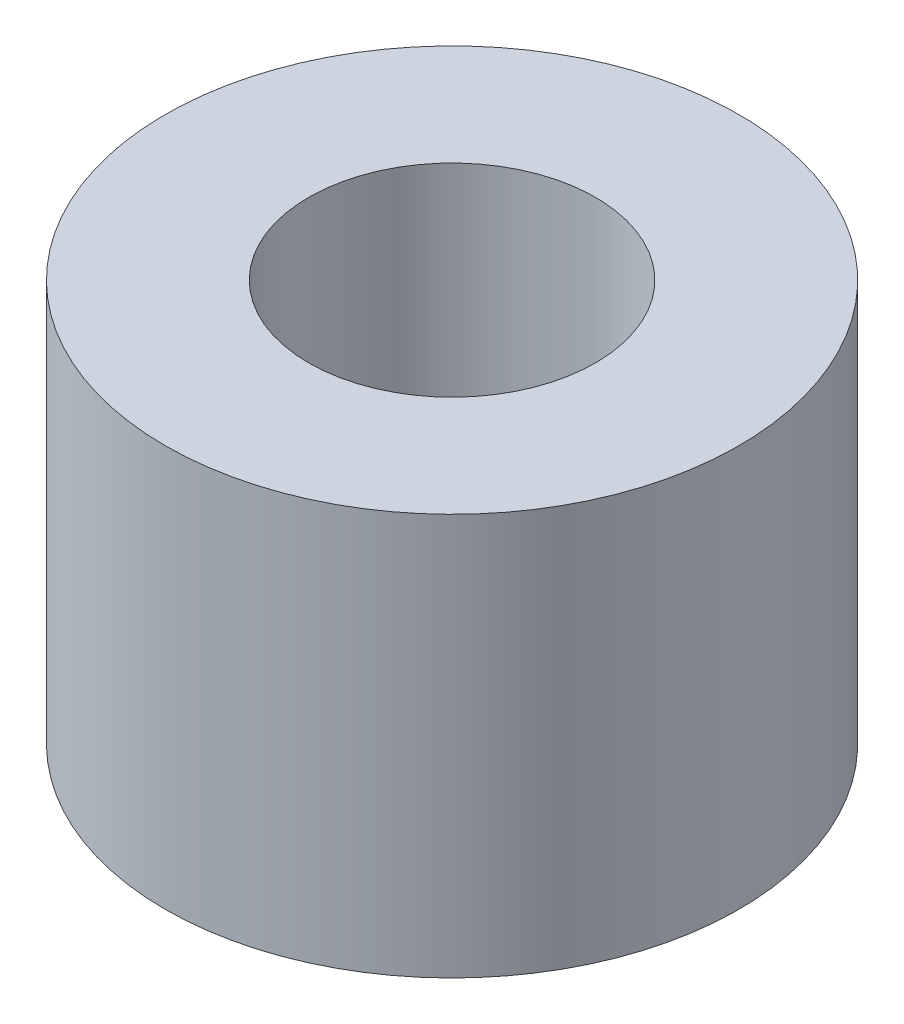
ISO-10303-21;
HEADER;
FILE_DESCRIPTION(('STEP AP214'),'2;1');
FILE_NAME('part.step','',(''),(''),'','','');
FILE_SCHEMA(('AUTOMOTIVE_DESIGN { 1 0 10303 214 1 1 1 1 }'));
ENDSEC;
DATA;
#1=APPLICATION_CONTEXT('core data for automotive mechanical design processes');
#2=APPLICATION_PROTOCOL_DEFINITION('international standard','automotive_design',2000,#1);
#3=PRODUCT_CONTEXT('',#1,'mechanical');
#4=PRODUCT('Part','Part','',(#3));
#5=PRODUCT_RELATED_PRODUCT_CATEGORY('part','',(#4));
#6=PRODUCT_DEFINITION_FORMATION('','',#4);
#7=PRODUCT_DEFINITION_CONTEXT('part definition',#1,'design');
#8=PRODUCT_DEFINITION('design','',#6,#7);
#9=PRODUCT_DEFINITION_SHAPE('','',#8);
#10=(LENGTH_UNIT() NAMED_UNIT(*) SI_UNIT(.MILLI.,.METRE.));
#11=(NAMED_UNIT(*) PLANE_ANGLE_UNIT() SI_UNIT($,.RADIAN.));
#12=(NAMED_UNIT(*) SI_UNIT($,.STERADIAN.) SOLID_ANGLE_UNIT());
#13=UNCERTAINTY_MEASURE_WITH_UNIT(LENGTH_MEASURE(1.E-05),#10,'distance_accuracy_value','');
#14=(GEOMETRIC_REPRESENTATION_CONTEXT(3) GLOBAL_UNCERTAINTY_ASSIGNED_CONTEXT((#13)) GLOBAL_UNIT_ASSIGNED_CONTEXT((#10,
#11,#12)) REPRESENTATION_CONTEXT('',''));
#15=CARTESIAN_POINT('',(0.,0.,0.));
#16=DIRECTION('',(0.,0.,1.));
#17=DIRECTION('',(1.,0.,0.));
#18=AXIS2_PLACEMENT_3D('',#15,#16,#17);
#19=CARTESIAN_POINT('',(0.,5.6,0.));
#20=DIRECTION('',(0.,1.,0.));
#21=DIRECTION('',(0.,0.,1.));
#22=AXIS2_PLACEMENT_3D('',#19,#20,#21);
#23=PLANE('',#22);
#24=CARTESIAN_POINT('',(0.,5.6,0.));
#25=DIRECTION('',(0.,1.,0.));
#26=DIRECTION('',(0.,0.,1.));
#27=AXIS2_PLACEMENT_3D('',#24,#25,#26);
#28=CIRCLE('',#27,4.);
#29=CARTESIAN_POINT('',(0.,5.6,3.99999999999998));
#30=VERTEX_POINT('',#29);
#31=EDGE_CURVE('E10',#30,#30,#28,.T.);
#32=ORIENTED_EDGE('',*,*,#31,.T.);
#33=EDGE_LOOP('',(#32));
#34=FACE_BOUND('',#33,.T.);
#35=CARTESIAN_POINT('',(0.,5.6,0.));
#36=DIRECTION('',(0.,1.,0.));
#37=DIRECTION('',(0.,0.,1.));
#38=AXIS2_PLACEMENT_3D('',#35,#36,#37);
#39=CIRCLE('',#38,2.);
#40=CARTESIAN_POINT('',(0.,5.6,1.99999999999998));
#41=VERTEX_POINT('',#40);
#42=EDGE_CURVE('E46',#41,#41,#39,.T.);
#43=ORIENTED_EDGE('',*,*,#42,.F.);
#44=EDGE_LOOP('',(#43));
#45=FACE_BOUND('',#44,.T.);
#46=ADVANCED_FACE('F35',(#34,#45),#23,.T.);
#47=CARTESIAN_POINT('',(0.,0.,0.));
#48=DIRECTION('',(0.,1.,0.));
#49=DIRECTION('',(0.,0.,1.));
#50=AXIS2_PLACEMENT_3D('',#47,#48,#49);
#51=PLANE('',#50);
#52=CARTESIAN_POINT('',(0.,0.,0.));
#53=DIRECTION('',(0.,1.,0.));
#54=DIRECTION('',(0.,0.,1.));
#55=AXIS2_PLACEMENT_3D('',#52,#53,#54);
#56=CIRCLE('',#55,4.);
#57=CARTESIAN_POINT('',(0.,0.,3.99999999999998));
#58=VERTEX_POINT('',#57);
#59=EDGE_CURVE('E39',#58,#58,#56,.T.);
#60=ORIENTED_EDGE('',*,*,#59,.F.);
#61=EDGE_LOOP('',(#60));
#62=FACE_BOUND('',#61,.T.);
#63=CARTESIAN_POINT('',(0.,0.,0.));
#64=DIRECTION('',(0.,1.,0.));
#65=DIRECTION('',(0.,0.,1.));
#66=AXIS2_PLACEMENT_3D('',#63,#64,#65);
#67=CIRCLE('',#66,2.);
#68=CARTESIAN_POINT('',(0.,0.,1.99999999999998));
#69=VERTEX_POINT('',#68);
#70=EDGE_CURVE('E48',#69,#69,#67,.T.);
#71=ORIENTED_EDGE('',*,*,#70,.T.);
#72=EDGE_LOOP('',(#71));
#73=FACE_BOUND('',#72,.T.);
#74=ADVANCED_FACE('F58',(#62,#73),#51,.F.);
#75=CARTESIAN_POINT('',(0.,5.6,0.));
#76=DIRECTION('',(0.,-1.,0.));
#77=DIRECTION('',(0.,0.,-1.));
#78=AXIS2_PLACEMENT_3D('',#75,#76,#77);
#79=CYLINDRICAL_SURFACE('',#78,4.);
#80=ORIENTED_EDGE('',*,*,#31,.F.);
#81=EDGE_LOOP('',(#80));
#82=FACE_BOUND('',#81,.T.);
#83=ORIENTED_EDGE('',*,*,#59,.T.);
#84=EDGE_LOOP('',(#83));
#85=FACE_BOUND('',#84,.T.);
#86=ADVANCED_FACE('F37',(#82,#85),#79,.T.);
#87=CARTESIAN_POINT('',(0.,5.6,0.));
#88=DIRECTION('',(0.,-1.,0.));
#89=DIRECTION('',(0.,0.,-1.));
#90=AXIS2_PLACEMENT_3D('',#87,#88,#89);
#91=CYLINDRICAL_SURFACE('',#90,2.);
#92=ORIENTED_EDGE('',*,*,#42,.T.);
#93=EDGE_LOOP('',(#92));
#94=FACE_BOUND('',#93,.T.);
#95=ORIENTED_EDGE('',*,*,#70,.F.);
#96=EDGE_LOOP('',(#95));
#97=FACE_BOUND('',#96,.T.);
#98=ADVANCED_FACE('F54',(#94,#97),#91,.F.);
#99=CLOSED_SHELL('',(#46,#74,#86,#98));
#100=MANIFOLD_SOLID_BREP('B2',#99);
#101=ADVANCED_BREP_SHAPE_REPRESENTATION('',(#18,#100),#14);
#102=SHAPE_DEFINITION_REPRESENTATION(#9,#101);
ENDSEC;
END-ISO-10303-21;
